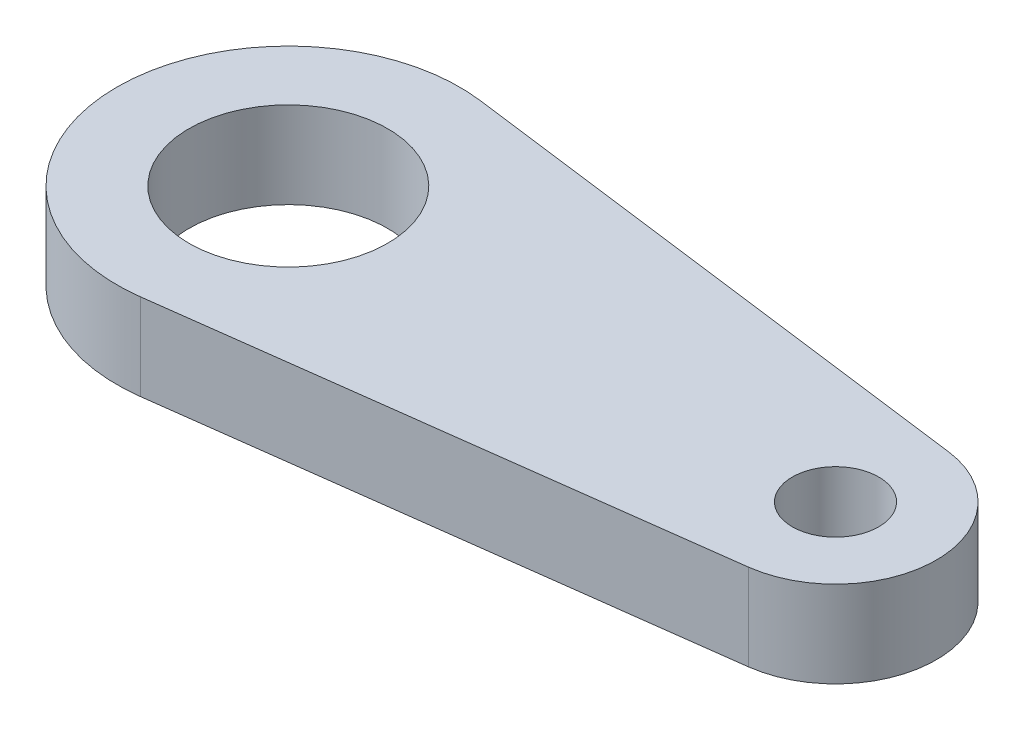
ISO-10303-21;
HEADER;
FILE_DESCRIPTION(('STEP AP214'),'2;1');
FILE_NAME('part.step','',(''),(''),'','','');
FILE_SCHEMA(('AUTOMOTIVE_DESIGN { 1 0 10303 214 1 1 1 1 }'));
ENDSEC;
DATA;
#1=APPLICATION_CONTEXT('core data for automotive mechanical design processes');
#2=APPLICATION_PROTOCOL_DEFINITION('international standard','automotive_design',2000,#1);
#3=PRODUCT_CONTEXT('',#1,'mechanical');
#4=PRODUCT('Part','Part','',(#3));
#5=PRODUCT_RELATED_PRODUCT_CATEGORY('part','',(#4));
#6=PRODUCT_DEFINITION_FORMATION('','',#4);
#7=PRODUCT_DEFINITION_CONTEXT('part definition',#1,'design');
#8=PRODUCT_DEFINITION('design','',#6,#7);
#9=PRODUCT_DEFINITION_SHAPE('','',#8);
#10=(LENGTH_UNIT() NAMED_UNIT(*) SI_UNIT(.MILLI.,.METRE.));
#11=(NAMED_UNIT(*) PLANE_ANGLE_UNIT() SI_UNIT($,.RADIAN.));
#12=(NAMED_UNIT(*) SI_UNIT($,.STERADIAN.) SOLID_ANGLE_UNIT());
#13=UNCERTAINTY_MEASURE_WITH_UNIT(LENGTH_MEASURE(1.E-05),#10,'distance_accuracy_value','');
#14=(GEOMETRIC_REPRESENTATION_CONTEXT(3) GLOBAL_UNCERTAINTY_ASSIGNED_CONTEXT((#13)) GLOBAL_UNIT_ASSIGNED_CONTEXT((#10,
#11,#12)) REPRESENTATION_CONTEXT('',''));
#15=CARTESIAN_POINT('',(0.,0.,0.));
#16=DIRECTION('',(0.,0.,1.));
#17=DIRECTION('',(1.,0.,0.));
#18=AXIS2_PLACEMENT_3D('',#15,#16,#17);
#19=CARTESIAN_POINT('',(19.,1.5,0.));
#20=DIRECTION('',(0.,1.,0.));
#21=DIRECTION('',(0.,0.,1.));
#22=AXIS2_PLACEMENT_3D('',#19,#20,#21);
#23=PLANE('',#22);
#24=CARTESIAN_POINT('',(19.,1.5,0.));
#25=DIRECTION('',(0.,1.,0.));
#26=DIRECTION('',(0.,0.,1.));
#27=AXIS2_PLACEMENT_3D('',#24,#25,#26);
#28=CIRCLE('',#27,1.5);
#29=CARTESIAN_POINT('',(19.,1.5,1.5));
#30=VERTEX_POINT('',#29);
#31=EDGE_CURVE('E103',#30,#30,#28,.T.);
#32=ORIENTED_EDGE('',*,*,#31,.F.);
#33=EDGE_LOOP('',(#32));
#34=FACE_BOUND('',#33,.T.);
#35=CARTESIAN_POINT('',(19.,1.5,0.));
#36=DIRECTION('',(0.,1.,0.));
#37=DIRECTION('',(0.,0.,1.));
#38=AXIS2_PLACEMENT_3D('',#35,#36,#37);
#39=CIRCLE('',#38,3.5);
#40=CARTESIAN_POINT('',(19.4513157894737,1.5,3.47078003598208));
#41=VERTEX_POINT('',#40);
#42=CARTESIAN_POINT('',(19.4513157894737,1.5,-3.47078003598208));
#43=VERTEX_POINT('',#42);
#44=EDGE_CURVE('E88',#41,#43,#39,.T.);
#45=ORIENTED_EDGE('',*,*,#44,.T.);
#46=DIRECTION('',(-0.991651438852022,0.,-0.128947368421053));
#47=VECTOR('',#46,1.);
#48=CARTESIAN_POINT('',(19.4513157894737,1.5,-3.47078003598208));
#49=LINE('',#48,#47);
#50=CARTESIAN_POINT('',(0.767236842105263,1.5,-5.90032606116953));
#51=VERTEX_POINT('',#50);
#52=EDGE_CURVE('E83',#43,#51,#49,.T.);
#53=ORIENTED_EDGE('',*,*,#52,.T.);
#54=CARTESIAN_POINT('',(0.,1.5,0.));
#55=DIRECTION('',(0.,1.,0.));
#56=DIRECTION('',(0.,0.,1.));
#57=AXIS2_PLACEMENT_3D('',#54,#55,#56);
#58=CIRCLE('',#57,5.95);
#59=CARTESIAN_POINT('',(0.767236842105266,1.5,5.90032606116953));
#60=VERTEX_POINT('',#59);
#61=EDGE_CURVE('E86',#51,#60,#58,.T.);
#62=ORIENTED_EDGE('',*,*,#61,.T.);
#63=DIRECTION('',(0.991651438852022,0.,-0.128947368421053));
#64=VECTOR('',#63,1.);
#65=CARTESIAN_POINT('',(19.4513157894737,1.5,3.47078003598208));
#66=LINE('',#65,#64);
#67=EDGE_CURVE('E53',#60,#41,#66,.T.);
#68=ORIENTED_EDGE('',*,*,#67,.T.);
#69=EDGE_LOOP('',(#45,#53,#62,#68));
#70=FACE_BOUND('',#69,.T.);
#71=CARTESIAN_POINT('',(0.,1.5,0.));
#72=DIRECTION('',(0.,1.,0.));
#73=DIRECTION('',(0.,0.,1.));
#74=AXIS2_PLACEMENT_3D('',#71,#72,#73);
#75=CIRCLE('',#74,3.45);
#76=CARTESIAN_POINT('',(0.,1.5,3.45));
#77=VERTEX_POINT('',#76);
#78=EDGE_CURVE('E118',#77,#77,#75,.T.);
#79=ORIENTED_EDGE('',*,*,#78,.F.);
#80=EDGE_LOOP('',(#79));
#81=FACE_BOUND('',#80,.T.);
#82=ADVANCED_FACE('F36',(#34,#70,#81),#23,.T.);
#83=CARTESIAN_POINT('',(19.,-1.5,0.));
#84=DIRECTION('',(0.,1.,0.));
#85=DIRECTION('',(0.,0.,1.));
#86=AXIS2_PLACEMENT_3D('',#83,#84,#85);
#87=PLANE('',#86);
#88=CARTESIAN_POINT('',(19.,-1.5,0.));
#89=DIRECTION('',(0.,1.,0.));
#90=DIRECTION('',(0.,0.,1.));
#91=AXIS2_PLACEMENT_3D('',#88,#89,#90);
#92=CIRCLE('',#91,3.5);
#93=CARTESIAN_POINT('',(19.4513157894737,-1.5,3.47078003598208));
#94=VERTEX_POINT('',#93);
#95=CARTESIAN_POINT('',(19.4513157894737,-1.5,-3.47078003598208));
#96=VERTEX_POINT('',#95);
#97=EDGE_CURVE('E100',#94,#96,#92,.T.);
#98=ORIENTED_EDGE('',*,*,#97,.F.);
#99=DIRECTION('',(0.991651438852022,0.,-0.128947368421053));
#100=VECTOR('',#99,1.);
#101=CARTESIAN_POINT('',(19.4513157894737,-1.5,3.47078003598208));
#102=LINE('',#101,#100);
#103=CARTESIAN_POINT('',(0.767236842105266,-1.5,5.90032606116953));
#104=VERTEX_POINT('',#103);
#105=EDGE_CURVE('E76',#104,#94,#102,.T.);
#106=ORIENTED_EDGE('',*,*,#105,.F.);
#107=CARTESIAN_POINT('',(0.,-1.5,0.));
#108=DIRECTION('',(0.,1.,0.));
#109=DIRECTION('',(0.,0.,1.));
#110=AXIS2_PLACEMENT_3D('',#107,#108,#109);
#111=CIRCLE('',#110,5.95);
#112=CARTESIAN_POINT('',(0.767236842105263,-1.5,-5.90032606116953));
#113=VERTEX_POINT('',#112);
#114=EDGE_CURVE('E70',#113,#104,#111,.T.);
#115=ORIENTED_EDGE('',*,*,#114,.F.);
#116=DIRECTION('',(-0.991651438852022,0.,-0.128947368421053));
#117=VECTOR('',#116,1.);
#118=CARTESIAN_POINT('',(19.4513157894737,-1.5,-3.47078003598208));
#119=LINE('',#118,#117);
#120=EDGE_CURVE('E92',#96,#113,#119,.T.);
#121=ORIENTED_EDGE('',*,*,#120,.F.);
#122=EDGE_LOOP('',(#98,#106,#115,#121));
#123=FACE_BOUND('',#122,.T.);
#124=CARTESIAN_POINT('',(19.,-1.5,0.));
#125=DIRECTION('',(0.,1.,0.));
#126=DIRECTION('',(0.,0.,1.));
#127=AXIS2_PLACEMENT_3D('',#124,#125,#126);
#128=CIRCLE('',#127,1.5);
#129=CARTESIAN_POINT('',(19.,-1.5,1.5));
#130=VERTEX_POINT('',#129);
#131=EDGE_CURVE('E115',#130,#130,#128,.T.);
#132=ORIENTED_EDGE('',*,*,#131,.T.);
#133=EDGE_LOOP('',(#132));
#134=FACE_BOUND('',#133,.T.);
#135=CARTESIAN_POINT('',(0.,-1.5,0.));
#136=DIRECTION('',(0.,1.,0.));
#137=DIRECTION('',(0.,0.,1.));
#138=AXIS2_PLACEMENT_3D('',#135,#136,#137);
#139=CIRCLE('',#138,3.45);
#140=CARTESIAN_POINT('',(0.,-1.5,3.45));
#141=VERTEX_POINT('',#140);
#142=EDGE_CURVE('E121',#141,#141,#139,.T.);
#143=ORIENTED_EDGE('',*,*,#142,.T.);
#144=EDGE_LOOP('',(#143));
#145=FACE_BOUND('',#144,.T.);
#146=ADVANCED_FACE('F111',(#123,#134,#145),#87,.F.);
#147=CARTESIAN_POINT('',(19.,1.5,0.));
#148=DIRECTION('',(0.,-1.,0.));
#149=DIRECTION('',(0.,0.,-1.));
#150=AXIS2_PLACEMENT_3D('',#147,#148,#149);
#151=CYLINDRICAL_SURFACE('',#150,3.5);
#152=ORIENTED_EDGE('',*,*,#97,.T.);
#153=DIRECTION('',(0.,-1.,0.));
#154=VECTOR('',#153,1.);
#155=CARTESIAN_POINT('',(19.4513157894737,1.5,-3.47078003598208));
#156=LINE('',#155,#154);
#157=EDGE_CURVE('E11',#43,#96,#156,.T.);
#158=ORIENTED_EDGE('',*,*,#157,.F.);
#159=ORIENTED_EDGE('',*,*,#44,.F.);
#160=DIRECTION('',(0.,-1.,0.));
#161=VECTOR('',#160,1.);
#162=CARTESIAN_POINT('',(19.4513157894737,1.5,3.47078003598208));
#163=LINE('',#162,#161);
#164=EDGE_CURVE('E96',#41,#94,#163,.T.);
#165=ORIENTED_EDGE('',*,*,#164,.T.);
#166=EDGE_LOOP('',(#152,#158,#159,#165));
#167=FACE_BOUND('',#166,.T.);
#168=ADVANCED_FACE('F38',(#167),#151,.T.);
#169=CARTESIAN_POINT('',(19.4513157894737,1.5,-3.47078003598208));
#170=DIRECTION('',(-0.128947368421053,0.,0.991651438852022));
#171=DIRECTION('',(0.991651438852022,0.,0.128947368421053));
#172=AXIS2_PLACEMENT_3D('',#169,#170,#171);
#173=PLANE('',#172);
#174=ORIENTED_EDGE('',*,*,#120,.T.);
#175=DIRECTION('',(0.,-1.,0.));
#176=VECTOR('',#175,1.);
#177=CARTESIAN_POINT('',(0.767236842105263,1.5,-5.90032606116953));
#178=LINE('',#177,#176);
#179=EDGE_CURVE('E45',#51,#113,#178,.T.);
#180=ORIENTED_EDGE('',*,*,#179,.F.);
#181=ORIENTED_EDGE('',*,*,#52,.F.);
#182=ORIENTED_EDGE('',*,*,#157,.T.);
#183=EDGE_LOOP('',(#174,#180,#181,#182));
#184=FACE_BOUND('',#183,.T.);
#185=ADVANCED_FACE('F91',(#184),#173,.F.);
#186=CARTESIAN_POINT('',(0.,1.5,0.));
#187=DIRECTION('',(0.,-1.,0.));
#188=DIRECTION('',(0.,0.,-1.));
#189=AXIS2_PLACEMENT_3D('',#186,#187,#188);
#190=CYLINDRICAL_SURFACE('',#189,5.95);
#191=ORIENTED_EDGE('',*,*,#114,.T.);
#192=DIRECTION('',(0.,-1.,0.));
#193=VECTOR('',#192,1.);
#194=CARTESIAN_POINT('',(0.767236842105266,1.5,5.90032606116953));
#195=LINE('',#194,#193);
#196=EDGE_CURVE('E93',#60,#104,#195,.T.);
#197=ORIENTED_EDGE('',*,*,#196,.F.);
#198=ORIENTED_EDGE('',*,*,#61,.F.);
#199=ORIENTED_EDGE('',*,*,#179,.T.);
#200=EDGE_LOOP('',(#191,#197,#198,#199));
#201=FACE_BOUND('',#200,.T.);
#202=ADVANCED_FACE('F94',(#201),#190,.T.);
#203=CARTESIAN_POINT('',(19.4513157894737,1.5,3.47078003598208));
#204=DIRECTION('',(-0.128947368421053,0.,-0.991651438852022));
#205=DIRECTION('',(-0.991651438852022,0.,0.128947368421053));
#206=AXIS2_PLACEMENT_3D('',#203,#204,#205);
#207=PLANE('',#206);
#208=ORIENTED_EDGE('',*,*,#105,.T.);
#209=ORIENTED_EDGE('',*,*,#164,.F.);
#210=ORIENTED_EDGE('',*,*,#67,.F.);
#211=ORIENTED_EDGE('',*,*,#196,.T.);
#212=EDGE_LOOP('',(#208,#209,#210,#211));
#213=FACE_BOUND('',#212,.T.);
#214=ADVANCED_FACE('F108',(#213),#207,.F.);
#215=CARTESIAN_POINT('',(19.,1.5,0.));
#216=DIRECTION('',(0.,-1.,0.));
#217=DIRECTION('',(0.,0.,-1.));
#218=AXIS2_PLACEMENT_3D('',#215,#216,#217);
#219=CYLINDRICAL_SURFACE('',#218,1.5);
#220=ORIENTED_EDGE('',*,*,#31,.T.);
#221=EDGE_LOOP('',(#220));
#222=FACE_BOUND('',#221,.T.);
#223=ORIENTED_EDGE('',*,*,#131,.F.);
#224=EDGE_LOOP('',(#223));
#225=FACE_BOUND('',#224,.T.);
#226=ADVANCED_FACE('F138',(#222,#225),#219,.F.);
#227=CARTESIAN_POINT('',(0.,1.5,0.));
#228=DIRECTION('',(0.,-1.,0.));
#229=DIRECTION('',(0.,0.,-1.));
#230=AXIS2_PLACEMENT_3D('',#227,#228,#229);
#231=CYLINDRICAL_SURFACE('',#230,3.45);
#232=ORIENTED_EDGE('',*,*,#78,.T.);
#233=EDGE_LOOP('',(#232));
#234=FACE_BOUND('',#233,.T.);
#235=ORIENTED_EDGE('',*,*,#142,.F.);
#236=EDGE_LOOP('',(#235));
#237=FACE_BOUND('',#236,.T.);
#238=ADVANCED_FACE('F127',(#234,#237),#231,.F.);
#239=CLOSED_SHELL('',(#82,#146,#168,#185,#202,#214,#226,#238));
#240=MANIFOLD_SOLID_BREP('B2',#239);
#241=ADVANCED_BREP_SHAPE_REPRESENTATION('',(#18,#240),#14);
#242=SHAPE_DEFINITION_REPRESENTATION(#9,#241);
ENDSEC;
END-ISO-10303-21;
